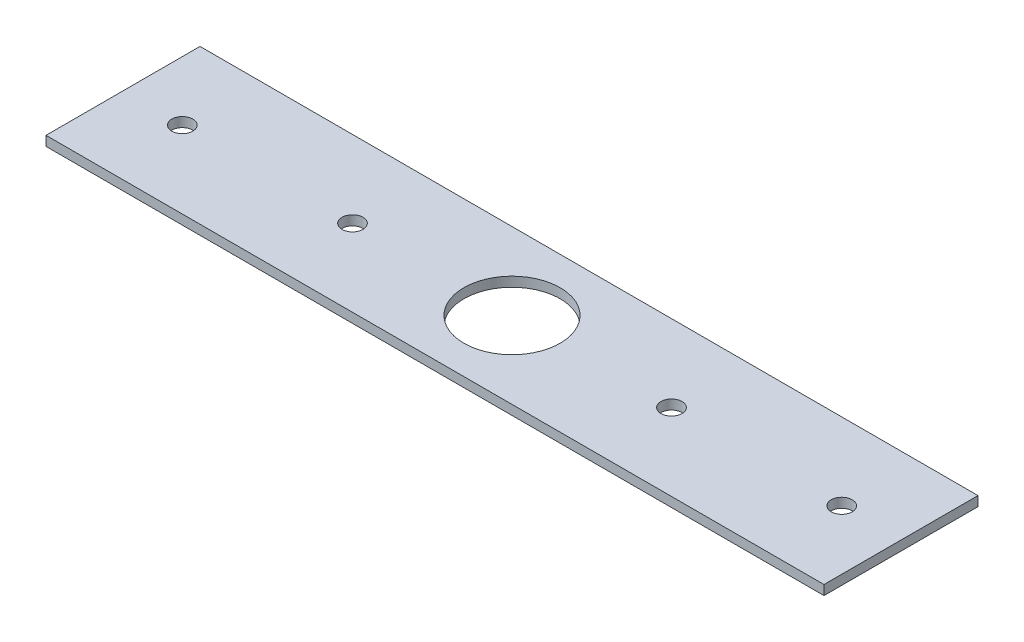
ISO-10303-21;
HEADER;
FILE_DESCRIPTION(('STEP AP214'),'2;1');
FILE_NAME('part.step','',(''),(''),'','','');
FILE_SCHEMA(('AUTOMOTIVE_DESIGN { 1 0 10303 214 1 1 1 1 }'));
ENDSEC;
DATA;
#1=APPLICATION_CONTEXT('core data for automotive mechanical design processes');
#2=APPLICATION_PROTOCOL_DEFINITION('international standard','automotive_design',2000,#1);
#3=PRODUCT_CONTEXT('',#1,'mechanical');
#4=PRODUCT('Part','Part','',(#3));
#5=PRODUCT_RELATED_PRODUCT_CATEGORY('part','',(#4));
#6=PRODUCT_DEFINITION_FORMATION('','',#4);
#7=PRODUCT_DEFINITION_CONTEXT('part definition',#1,'design');
#8=PRODUCT_DEFINITION('design','',#6,#7);
#9=PRODUCT_DEFINITION_SHAPE('','',#8);
#10=(LENGTH_UNIT() NAMED_UNIT(*) SI_UNIT(.MILLI.,.METRE.));
#11=(NAMED_UNIT(*) PLANE_ANGLE_UNIT() SI_UNIT($,.RADIAN.));
#12=(NAMED_UNIT(*) SI_UNIT($,.STERADIAN.) SOLID_ANGLE_UNIT());
#13=UNCERTAINTY_MEASURE_WITH_UNIT(LENGTH_MEASURE(1.E-05),#10,'distance_accuracy_value','');
#14=(GEOMETRIC_REPRESENTATION_CONTEXT(3) GLOBAL_UNCERTAINTY_ASSIGNED_CONTEXT((#13)) GLOBAL_UNIT_ASSIGNED_CONTEXT((#10,
#11,#12)) REPRESENTATION_CONTEXT('',''));
#15=CARTESIAN_POINT('',(0.,0.,0.));
#16=DIRECTION('',(0.,0.,1.));
#17=DIRECTION('',(1.,0.,0.));
#18=AXIS2_PLACEMENT_3D('',#15,#16,#17);
#19=CARTESIAN_POINT('',(0.,1.,0.));
#20=DIRECTION('',(0.,1.,0.));
#21=DIRECTION('',(0.,0.,1.));
#22=AXIS2_PLACEMENT_3D('',#19,#20,#21);
#23=PLANE('',#22);
#24=CARTESIAN_POINT('',(-17.4559654443541,1.,-14.2656775221078));
#25=DIRECTION('',(0.,1.,0.));
#26=DIRECTION('',(0.,0.,1.));
#27=AXIS2_PLACEMENT_3D('',#24,#25,#26);
#28=CIRCLE('',#27,1.09);
#29=CARTESIAN_POINT('',(-17.4559654443541,1.,-13.1756775221078));
#30=VERTEX_POINT('',#29);
#31=EDGE_CURVE('E127',#30,#30,#28,.T.);
#32=ORIENTED_EDGE('',*,*,#31,.F.);
#33=EDGE_LOOP('',(#32));
#34=FACE_BOUND('',#33,.T.);
#35=CARTESIAN_POINT('',(-35.1359654443541,1.,-14.2656775221078));
#36=DIRECTION('',(0.,1.,0.));
#37=DIRECTION('',(0.,0.,1.));
#38=AXIS2_PLACEMENT_3D('',#35,#36,#37);
#39=CIRCLE('',#38,1.09);
#40=CARTESIAN_POINT('',(-35.1359654443541,1.,-13.1756775221078));
#41=VERTEX_POINT('',#40);
#42=EDGE_CURVE('E115',#41,#41,#39,.T.);
#43=ORIENTED_EDGE('',*,*,#42,.F.);
#44=EDGE_LOOP('',(#43));
#45=FACE_BOUND('',#44,.T.);
#46=DIRECTION('',(0.,0.,1.));
#47=VECTOR('',#46,1.);
#48=CARTESIAN_POINT('',(-41.2959654443541,1.,-22.2656775221078));
#49=LINE('',#48,#47);
#50=CARTESIAN_POINT('',(-41.2959654443541,1.,-22.2656775221078));
#51=VERTEX_POINT('',#50);
#52=CARTESIAN_POINT('',(-41.2959654443541,1.,-6.26567752210782));
#53=VERTEX_POINT('',#52);
#54=EDGE_CURVE('E85',#51,#53,#49,.T.);
#55=ORIENTED_EDGE('',*,*,#54,.T.);
#56=DIRECTION('',(1.,0.,0.));
#57=VECTOR('',#56,1.);
#58=CARTESIAN_POINT('',(-41.2959654443541,1.,-6.26567752210782));
#59=LINE('',#58,#57);
#60=CARTESIAN_POINT('',(39.5240345556459,1.,-6.26567752210782));
#61=VERTEX_POINT('',#60);
#62=EDGE_CURVE('E80',#53,#61,#59,.T.);
#63=ORIENTED_EDGE('',*,*,#62,.T.);
#64=DIRECTION('',(0.,0.,-1.));
#65=VECTOR('',#64,1.);
#66=CARTESIAN_POINT('',(39.5240345556459,1.,-22.2656775221078));
#67=LINE('',#66,#65);
#68=CARTESIAN_POINT('',(39.5240345556459,1.,-22.2656775221078));
#69=VERTEX_POINT('',#68);
#70=EDGE_CURVE('E83',#61,#69,#67,.T.);
#71=ORIENTED_EDGE('',*,*,#70,.T.);
#72=DIRECTION('',(-1.,0.,0.));
#73=VECTOR('',#72,1.);
#74=CARTESIAN_POINT('',(-41.2959654443541,1.,-22.2656775221078));
#75=LINE('',#74,#73);
#76=EDGE_CURVE('E50',#69,#51,#75,.T.);
#77=ORIENTED_EDGE('',*,*,#76,.T.);
#78=EDGE_LOOP('',(#55,#63,#71,#77));
#79=FACE_BOUND('',#78,.T.);
#80=CARTESIAN_POINT('',(-0.88596544435407,1.,-14.2656775221078));
#81=DIRECTION('',(0.,1.,0.));
#82=DIRECTION('',(0.,0.,1.));
#83=AXIS2_PLACEMENT_3D('',#80,#81,#82);
#84=CIRCLE('',#83,5.);
#85=CARTESIAN_POINT('',(-0.88596544435407,1.,-9.26567752210781));
#86=VERTEX_POINT('',#85);
#87=EDGE_CURVE('E100',#86,#86,#84,.T.);
#88=ORIENTED_EDGE('',*,*,#87,.F.);
#89=EDGE_LOOP('',(#88));
#90=FACE_BOUND('',#89,.T.);
#91=CARTESIAN_POINT('',(33.3640345556459,1.,-14.2656775221078));
#92=DIRECTION('',(0.,1.,0.));
#93=DIRECTION('',(0.,0.,1.));
#94=AXIS2_PLACEMENT_3D('',#91,#92,#93);
#95=CIRCLE('',#94,1.09);
#96=CARTESIAN_POINT('',(33.3640345556459,1.,-13.1756775221078));
#97=VERTEX_POINT('',#96);
#98=EDGE_CURVE('E121',#97,#97,#95,.T.);
#99=ORIENTED_EDGE('',*,*,#98,.F.);
#100=EDGE_LOOP('',(#99));
#101=FACE_BOUND('',#100,.T.);
#102=CARTESIAN_POINT('',(15.6840345556459,1.,-14.2656775221078));
#103=DIRECTION('',(0.,1.,0.));
#104=DIRECTION('',(0.,0.,1.));
#105=AXIS2_PLACEMENT_3D('',#102,#103,#104);
#106=CIRCLE('',#105,1.09);
#107=CARTESIAN_POINT('',(15.6840345556459,1.,-13.1756775221078));
#108=VERTEX_POINT('',#107);
#109=EDGE_CURVE('E133',#108,#108,#106,.T.);
#110=ORIENTED_EDGE('',*,*,#109,.F.);
#111=EDGE_LOOP('',(#110));
#112=FACE_BOUND('',#111,.T.);
#113=ADVANCED_FACE('F33',(#34,#45,#79,#90,#101,#112),#23,.T.);
#114=CARTESIAN_POINT('',(0.,0.,0.));
#115=DIRECTION('',(0.,1.,0.));
#116=DIRECTION('',(0.,0.,1.));
#117=AXIS2_PLACEMENT_3D('',#114,#115,#116);
#118=PLANE('',#117);
#119=DIRECTION('',(0.,0.,1.));
#120=VECTOR('',#119,1.);
#121=CARTESIAN_POINT('',(-41.2959654443541,0.,-22.2656775221078));
#122=LINE('',#121,#120);
#123=CARTESIAN_POINT('',(-41.2959654443541,0.,-22.2656775221078));
#124=VERTEX_POINT('',#123);
#125=CARTESIAN_POINT('',(-41.2959654443541,0.,-6.26567752210782));
#126=VERTEX_POINT('',#125);
#127=EDGE_CURVE('E97',#124,#126,#122,.T.);
#128=ORIENTED_EDGE('',*,*,#127,.F.);
#129=DIRECTION('',(-1.,0.,0.));
#130=VECTOR('',#129,1.);
#131=CARTESIAN_POINT('',(-41.2959654443541,0.,-22.2656775221078));
#132=LINE('',#131,#130);
#133=CARTESIAN_POINT('',(39.5240345556459,0.,-22.2656775221078));
#134=VERTEX_POINT('',#133);
#135=EDGE_CURVE('E73',#134,#124,#132,.T.);
#136=ORIENTED_EDGE('',*,*,#135,.F.);
#137=DIRECTION('',(0.,0.,-1.));
#138=VECTOR('',#137,1.);
#139=CARTESIAN_POINT('',(39.5240345556459,0.,-22.2656775221078));
#140=LINE('',#139,#138);
#141=CARTESIAN_POINT('',(39.5240345556459,0.,-6.26567752210782));
#142=VERTEX_POINT('',#141);
#143=EDGE_CURVE('E67',#142,#134,#140,.T.);
#144=ORIENTED_EDGE('',*,*,#143,.F.);
#145=DIRECTION('',(1.,0.,0.));
#146=VECTOR('',#145,1.);
#147=CARTESIAN_POINT('',(-41.2959654443541,0.,-6.26567752210782));
#148=LINE('',#147,#146);
#149=EDGE_CURVE('E89',#126,#142,#148,.T.);
#150=ORIENTED_EDGE('',*,*,#149,.F.);
#151=EDGE_LOOP('',(#128,#136,#144,#150));
#152=FACE_BOUND('',#151,.T.);
#153=CARTESIAN_POINT('',(-0.88596544435407,0.,-14.2656775221078));
#154=DIRECTION('',(0.,1.,0.));
#155=DIRECTION('',(0.,0.,1.));
#156=AXIS2_PLACEMENT_3D('',#153,#154,#155);
#157=CIRCLE('',#156,5.);
#158=CARTESIAN_POINT('',(-0.88596544435407,0.,-9.26567752210781));
#159=VERTEX_POINT('',#158);
#160=EDGE_CURVE('E112',#159,#159,#157,.T.);
#161=ORIENTED_EDGE('',*,*,#160,.T.);
#162=EDGE_LOOP('',(#161));
#163=FACE_BOUND('',#162,.T.);
#164=CARTESIAN_POINT('',(-35.1359654443541,0.,-14.2656775221078));
#165=DIRECTION('',(0.,1.,0.));
#166=DIRECTION('',(0.,0.,1.));
#167=AXIS2_PLACEMENT_3D('',#164,#165,#166);
#168=CIRCLE('',#167,1.09);
#169=CARTESIAN_POINT('',(-35.1359654443541,0.,-13.1756775221078));
#170=VERTEX_POINT('',#169);
#171=EDGE_CURVE('E118',#170,#170,#168,.T.);
#172=ORIENTED_EDGE('',*,*,#171,.T.);
#173=EDGE_LOOP('',(#172));
#174=FACE_BOUND('',#173,.T.);
#175=CARTESIAN_POINT('',(33.3640345556459,0.,-14.2656775221078));
#176=DIRECTION('',(0.,1.,0.));
#177=DIRECTION('',(0.,0.,1.));
#178=AXIS2_PLACEMENT_3D('',#175,#176,#177);
#179=CIRCLE('',#178,1.09);
#180=CARTESIAN_POINT('',(33.3640345556459,0.,-13.1756775221078));
#181=VERTEX_POINT('',#180);
#182=EDGE_CURVE('E124',#181,#181,#179,.T.);
#183=ORIENTED_EDGE('',*,*,#182,.T.);
#184=EDGE_LOOP('',(#183));
#185=FACE_BOUND('',#184,.T.);
#186=CARTESIAN_POINT('',(-17.4559654443541,0.,-14.2656775221078));
#187=DIRECTION('',(0.,1.,0.));
#188=DIRECTION('',(0.,0.,1.));
#189=AXIS2_PLACEMENT_3D('',#186,#187,#188);
#190=CIRCLE('',#189,1.09);
#191=CARTESIAN_POINT('',(-17.4559654443541,0.,-13.1756775221078));
#192=VERTEX_POINT('',#191);
#193=EDGE_CURVE('E130',#192,#192,#190,.T.);
#194=ORIENTED_EDGE('',*,*,#193,.T.);
#195=EDGE_LOOP('',(#194));
#196=FACE_BOUND('',#195,.T.);
#197=CARTESIAN_POINT('',(15.6840345556459,0.,-14.2656775221078));
#198=DIRECTION('',(0.,1.,0.));
#199=DIRECTION('',(0.,0.,1.));
#200=AXIS2_PLACEMENT_3D('',#197,#198,#199);
#201=CIRCLE('',#200,1.09);
#202=CARTESIAN_POINT('',(15.6840345556459,0.,-13.1756775221078));
#203=VERTEX_POINT('',#202);
#204=EDGE_CURVE('E136',#203,#203,#201,.T.);
#205=ORIENTED_EDGE('',*,*,#204,.T.);
#206=EDGE_LOOP('',(#205));
#207=FACE_BOUND('',#206,.T.);
#208=ADVANCED_FACE('F108',(#152,#163,#174,#185,#196,#207),#118,.F.);
#209=CARTESIAN_POINT('',(-41.2959654443541,1.,-22.2656775221078));
#210=DIRECTION('',(1.,0.,0.));
#211=DIRECTION('',(0.,0.,-1.));
#212=AXIS2_PLACEMENT_3D('',#209,#210,#211);
#213=PLANE('',#212);
#214=ORIENTED_EDGE('',*,*,#127,.T.);
#215=DIRECTION('',(0.,-1.,0.));
#216=VECTOR('',#215,1.);
#217=CARTESIAN_POINT('',(-41.2959654443541,1.,-6.26567752210782));
#218=LINE('',#217,#216);
#219=EDGE_CURVE('E11',#53,#126,#218,.T.);
#220=ORIENTED_EDGE('',*,*,#219,.F.);
#221=ORIENTED_EDGE('',*,*,#54,.F.);
#222=DIRECTION('',(0.,-1.,0.));
#223=VECTOR('',#222,1.);
#224=CARTESIAN_POINT('',(-41.2959654443541,1.,-22.2656775221078));
#225=LINE('',#224,#223);
#226=EDGE_CURVE('E93',#51,#124,#225,.T.);
#227=ORIENTED_EDGE('',*,*,#226,.T.);
#228=EDGE_LOOP('',(#214,#220,#221,#227));
#229=FACE_BOUND('',#228,.T.);
#230=ADVANCED_FACE('F35',(#229),#213,.F.);
#231=CARTESIAN_POINT('',(-41.2959654443541,1.,-6.26567752210782));
#232=DIRECTION('',(0.,0.,-1.));
#233=DIRECTION('',(-1.,0.,0.));
#234=AXIS2_PLACEMENT_3D('',#231,#232,#233);
#235=PLANE('',#234);
#236=ORIENTED_EDGE('',*,*,#149,.T.);
#237=DIRECTION('',(0.,-1.,0.));
#238=VECTOR('',#237,1.);
#239=CARTESIAN_POINT('',(39.5240345556459,1.,-6.26567752210782));
#240=LINE('',#239,#238);
#241=EDGE_CURVE('E42',#61,#142,#240,.T.);
#242=ORIENTED_EDGE('',*,*,#241,.F.);
#243=ORIENTED_EDGE('',*,*,#62,.F.);
#244=ORIENTED_EDGE('',*,*,#219,.T.);
#245=EDGE_LOOP('',(#236,#242,#243,#244));
#246=FACE_BOUND('',#245,.T.);
#247=ADVANCED_FACE('F88',(#246),#235,.F.);
#248=CARTESIAN_POINT('',(39.5240345556459,1.,-22.2656775221078));
#249=DIRECTION('',(-1.,0.,0.));
#250=DIRECTION('',(0.,0.,1.));
#251=AXIS2_PLACEMENT_3D('',#248,#249,#250);
#252=PLANE('',#251);
#253=ORIENTED_EDGE('',*,*,#143,.T.);
#254=DIRECTION('',(0.,-1.,0.));
#255=VECTOR('',#254,1.);
#256=CARTESIAN_POINT('',(39.5240345556459,1.,-22.2656775221078));
#257=LINE('',#256,#255);
#258=EDGE_CURVE('E90',#69,#134,#257,.T.);
#259=ORIENTED_EDGE('',*,*,#258,.F.);
#260=ORIENTED_EDGE('',*,*,#70,.F.);
#261=ORIENTED_EDGE('',*,*,#241,.T.);
#262=EDGE_LOOP('',(#253,#259,#260,#261));
#263=FACE_BOUND('',#262,.T.);
#264=ADVANCED_FACE('F91',(#263),#252,.F.);
#265=CARTESIAN_POINT('',(-41.2959654443541,1.,-22.2656775221078));
#266=DIRECTION('',(0.,0.,1.));
#267=DIRECTION('',(1.,0.,0.));
#268=AXIS2_PLACEMENT_3D('',#265,#266,#267);
#269=PLANE('',#268);
#270=ORIENTED_EDGE('',*,*,#135,.T.);
#271=ORIENTED_EDGE('',*,*,#226,.F.);
#272=ORIENTED_EDGE('',*,*,#76,.F.);
#273=ORIENTED_EDGE('',*,*,#258,.T.);
#274=EDGE_LOOP('',(#270,#271,#272,#273));
#275=FACE_BOUND('',#274,.T.);
#276=ADVANCED_FACE('F105',(#275),#269,.F.);
#277=CARTESIAN_POINT('',(-0.88596544435407,1.,-14.2656775221078));
#278=DIRECTION('',(0.,-1.,0.));
#279=DIRECTION('',(0.,0.,-1.));
#280=AXIS2_PLACEMENT_3D('',#277,#278,#279);
#281=CYLINDRICAL_SURFACE('',#280,5.);
#282=ORIENTED_EDGE('',*,*,#87,.T.);
#283=EDGE_LOOP('',(#282));
#284=FACE_BOUND('',#283,.T.);
#285=ORIENTED_EDGE('',*,*,#160,.F.);
#286=EDGE_LOOP('',(#285));
#287=FACE_BOUND('',#286,.T.);
#288=ADVANCED_FACE('F155',(#284,#287),#281,.F.);
#289=CARTESIAN_POINT('',(-35.1359654443541,1.,-14.2656775221078));
#290=DIRECTION('',(0.,-1.,0.));
#291=DIRECTION('',(0.,0.,-1.));
#292=AXIS2_PLACEMENT_3D('',#289,#290,#291);
#293=CYLINDRICAL_SURFACE('',#292,1.09);
#294=ORIENTED_EDGE('',*,*,#42,.T.);
#295=EDGE_LOOP('',(#294));
#296=FACE_BOUND('',#295,.T.);
#297=ORIENTED_EDGE('',*,*,#171,.F.);
#298=EDGE_LOOP('',(#297));
#299=FACE_BOUND('',#298,.T.);
#300=ADVANCED_FACE('F201',(#296,#299),#293,.F.);
#301=CARTESIAN_POINT('',(33.3640345556459,1.,-14.2656775221078));
#302=DIRECTION('',(0.,-1.,0.));
#303=DIRECTION('',(0.,0.,-1.));
#304=AXIS2_PLACEMENT_3D('',#301,#302,#303);
#305=CYLINDRICAL_SURFACE('',#304,1.09);
#306=ORIENTED_EDGE('',*,*,#98,.T.);
#307=EDGE_LOOP('',(#306));
#308=FACE_BOUND('',#307,.T.);
#309=ORIENTED_EDGE('',*,*,#182,.F.);
#310=EDGE_LOOP('',(#309));
#311=FACE_BOUND('',#310,.T.);
#312=ADVANCED_FACE('F209',(#308,#311),#305,.F.);
#313=CARTESIAN_POINT('',(-17.4559654443541,1.,-14.2656775221078));
#314=DIRECTION('',(0.,-1.,0.));
#315=DIRECTION('',(0.,0.,-1.));
#316=AXIS2_PLACEMENT_3D('',#313,#314,#315);
#317=CYLINDRICAL_SURFACE('',#316,1.09);
#318=ORIENTED_EDGE('',*,*,#31,.T.);
#319=EDGE_LOOP('',(#318));
#320=FACE_BOUND('',#319,.T.);
#321=ORIENTED_EDGE('',*,*,#193,.F.);
#322=EDGE_LOOP('',(#321));
#323=FACE_BOUND('',#322,.T.);
#324=ADVANCED_FACE('F217',(#320,#323),#317,.F.);
#325=CARTESIAN_POINT('',(15.6840345556459,1.,-14.2656775221078));
#326=DIRECTION('',(0.,-1.,0.));
#327=DIRECTION('',(0.,0.,-1.));
#328=AXIS2_PLACEMENT_3D('',#325,#326,#327);
#329=CYLINDRICAL_SURFACE('',#328,1.09);
#330=ORIENTED_EDGE('',*,*,#109,.T.);
#331=EDGE_LOOP('',(#330));
#332=FACE_BOUND('',#331,.T.);
#333=ORIENTED_EDGE('',*,*,#204,.F.);
#334=EDGE_LOOP('',(#333));
#335=FACE_BOUND('',#334,.T.);
#336=ADVANCED_FACE('F142',(#332,#335),#329,.F.);
#337=CLOSED_SHELL('',(#113,#208,#230,#247,#264,#276,#288,#300,#312,#324,#336));
#338=MANIFOLD_SOLID_BREP('B2',#337);
#339=ADVANCED_BREP_SHAPE_REPRESENTATION('',(#18,#338),#14);
#340=SHAPE_DEFINITION_REPRESENTATION(#9,#339);
ENDSEC;
END-ISO-10303-21;
